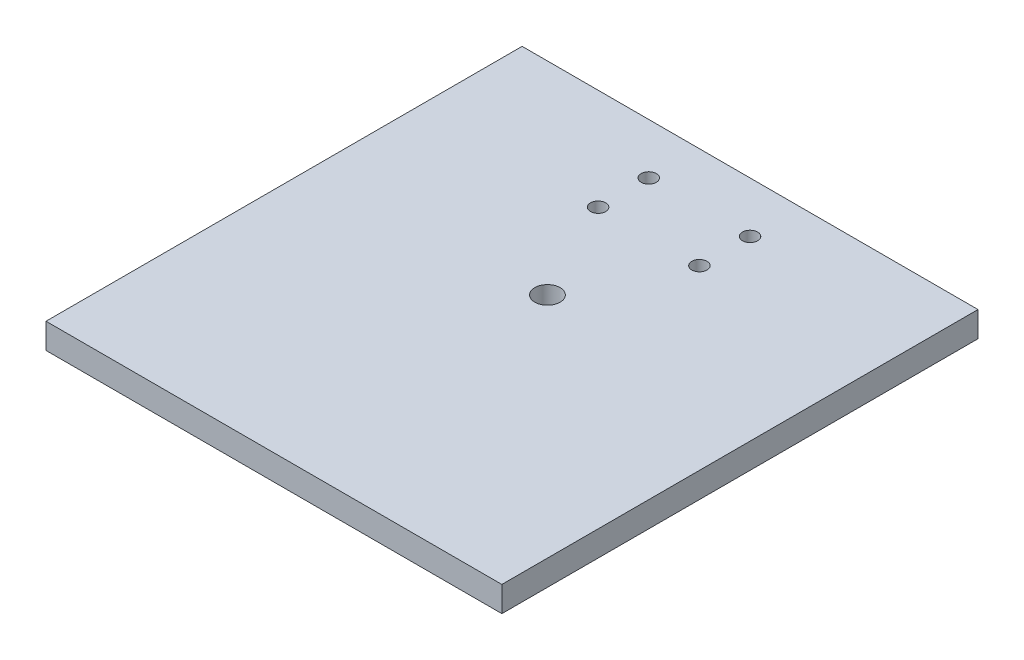
ISO-10303-21;
HEADER;
FILE_DESCRIPTION(('STEP AP214'),'2;1');
FILE_NAME('part.step','',(''),(''),'','','');
FILE_SCHEMA(('AUTOMOTIVE_DESIGN { 1 0 10303 214 1 1 1 1 }'));
ENDSEC;
DATA;
#1=APPLICATION_CONTEXT('core data for automotive mechanical design processes');
#2=APPLICATION_PROTOCOL_DEFINITION('international standard','automotive_design',2000,#1);
#3=PRODUCT_CONTEXT('',#1,'mechanical');
#4=PRODUCT('Part','Part','',(#3));
#5=PRODUCT_RELATED_PRODUCT_CATEGORY('part','',(#4));
#6=PRODUCT_DEFINITION_FORMATION('','',#4);
#7=PRODUCT_DEFINITION_CONTEXT('part definition',#1,'design');
#8=PRODUCT_DEFINITION('design','',#6,#7);
#9=PRODUCT_DEFINITION_SHAPE('','',#8);
#10=(LENGTH_UNIT() NAMED_UNIT(*) SI_UNIT(.MILLI.,.METRE.));
#11=(NAMED_UNIT(*) PLANE_ANGLE_UNIT() SI_UNIT($,.RADIAN.));
#12=(NAMED_UNIT(*) SI_UNIT($,.STERADIAN.) SOLID_ANGLE_UNIT());
#13=UNCERTAINTY_MEASURE_WITH_UNIT(LENGTH_MEASURE(1.E-05),#10,'distance_accuracy_value','');
#14=(GEOMETRIC_REPRESENTATION_CONTEXT(3) GLOBAL_UNCERTAINTY_ASSIGNED_CONTEXT((#13)) GLOBAL_UNIT_ASSIGNED_CONTEXT((#10,
#11,#12)) REPRESENTATION_CONTEXT('',''));
#15=CARTESIAN_POINT('',(0.,0.,0.));
#16=DIRECTION('',(0.,0.,1.));
#17=DIRECTION('',(1.,0.,0.));
#18=AXIS2_PLACEMENT_3D('',#15,#16,#17);
#19=CARTESIAN_POINT('',(0.,6.35,0.));
#20=DIRECTION('',(0.,0.,-1.));
#21=DIRECTION('',(-1.,0.,0.));
#22=AXIS2_PLACEMENT_3D('',#19,#20,#21);
#23=PLANE('',#22);
#24=DIRECTION('',(1.,0.,0.));
#25=VECTOR('',#24,1.);
#26=CARTESIAN_POINT('',(0.,0.,0.));
#27=LINE('',#26,#25);
#28=CARTESIAN_POINT('',(0.,0.,0.));
#29=VERTEX_POINT('',#28);
#30=CARTESIAN_POINT('',(114.3,0.,0.));
#31=VERTEX_POINT('',#30);
#32=EDGE_CURVE('E133',#29,#31,#27,.T.);
#33=ORIENTED_EDGE('',*,*,#32,.T.);
#34=DIRECTION('',(0.,-1.,0.));
#35=VECTOR('',#34,1.);
#36=CARTESIAN_POINT('',(114.3,6.35,0.));
#37=LINE('',#36,#35);
#38=CARTESIAN_POINT('',(114.3,6.35,0.));
#39=VERTEX_POINT('',#38);
#40=EDGE_CURVE('E11',#39,#31,#37,.T.);
#41=ORIENTED_EDGE('',*,*,#40,.F.);
#42=DIRECTION('',(1.,0.,0.));
#43=VECTOR('',#42,1.);
#44=CARTESIAN_POINT('',(0.,6.35,0.));
#45=LINE('',#44,#43);
#46=CARTESIAN_POINT('',(0.,6.35,0.));
#47=VERTEX_POINT('',#46);
#48=EDGE_CURVE('E95',#47,#39,#45,.T.);
#49=ORIENTED_EDGE('',*,*,#48,.F.);
#50=DIRECTION('',(0.,-1.,0.));
#51=VECTOR('',#50,1.);
#52=CARTESIAN_POINT('',(0.,6.35,0.));
#53=LINE('',#52,#51);
#54=EDGE_CURVE('E62',#47,#29,#53,.T.);
#55=ORIENTED_EDGE('',*,*,#54,.T.);
#56=EDGE_LOOP('',(#33,#41,#49,#55));
#57=FACE_BOUND('',#56,.T.);
#58=ADVANCED_FACE('F44',(#57),#23,.F.);
#59=CARTESIAN_POINT('',(114.3,6.35,0.));
#60=DIRECTION('',(-1.,0.,0.));
#61=DIRECTION('',(0.,0.,1.));
#62=AXIS2_PLACEMENT_3D('',#59,#60,#61);
#63=PLANE('',#62);
#64=DIRECTION('',(0.,0.,-1.));
#65=VECTOR('',#64,1.);
#66=CARTESIAN_POINT('',(114.3,0.,0.));
#67=LINE('',#66,#65);
#68=CARTESIAN_POINT('',(114.3,0.,-119.38));
#69=VERTEX_POINT('',#68);
#70=EDGE_CURVE('E101',#31,#69,#67,.T.);
#71=ORIENTED_EDGE('',*,*,#70,.T.);
#72=DIRECTION('',(0.,-1.,0.));
#73=VECTOR('',#72,1.);
#74=CARTESIAN_POINT('',(114.3,6.35,-119.38));
#75=LINE('',#74,#73);
#76=CARTESIAN_POINT('',(114.3,6.35,-119.38));
#77=VERTEX_POINT('',#76);
#78=EDGE_CURVE('E54',#77,#69,#75,.T.);
#79=ORIENTED_EDGE('',*,*,#78,.F.);
#80=DIRECTION('',(0.,0.,-1.));
#81=VECTOR('',#80,1.);
#82=CARTESIAN_POINT('',(114.3,6.35,0.));
#83=LINE('',#82,#81);
#84=EDGE_CURVE('E87',#39,#77,#83,.T.);
#85=ORIENTED_EDGE('',*,*,#84,.F.);
#86=ORIENTED_EDGE('',*,*,#40,.T.);
#87=EDGE_LOOP('',(#71,#79,#85,#86));
#88=FACE_BOUND('',#87,.T.);
#89=ADVANCED_FACE('F100',(#88),#63,.F.);
#90=CARTESIAN_POINT('',(0.,6.35,-119.38));
#91=DIRECTION('',(0.,0.,-1.));
#92=DIRECTION('',(-1.,0.,0.));
#93=AXIS2_PLACEMENT_3D('',#90,#91,#92);
#94=PLANE('',#93);
#95=DIRECTION('',(1.,0.,0.));
#96=VECTOR('',#95,1.);
#97=CARTESIAN_POINT('',(0.,0.,-119.38));
#98=LINE('',#97,#96);
#99=CARTESIAN_POINT('',(0.,0.,-119.38));
#100=VERTEX_POINT('',#99);
#101=EDGE_CURVE('E138',#100,#69,#98,.T.);
#102=ORIENTED_EDGE('',*,*,#101,.F.);
#103=DIRECTION('',(0.,-1.,0.));
#104=VECTOR('',#103,1.);
#105=CARTESIAN_POINT('',(0.,6.35,-119.38));
#106=LINE('',#105,#104);
#107=CARTESIAN_POINT('',(0.,6.35,-119.38));
#108=VERTEX_POINT('',#107);
#109=EDGE_CURVE('E76',#108,#100,#106,.T.);
#110=ORIENTED_EDGE('',*,*,#109,.F.);
#111=DIRECTION('',(1.,0.,0.));
#112=VECTOR('',#111,1.);
#113=CARTESIAN_POINT('',(0.,6.35,-119.38));
#114=LINE('',#113,#112);
#115=EDGE_CURVE('E94',#108,#77,#114,.T.);
#116=ORIENTED_EDGE('',*,*,#115,.T.);
#117=ORIENTED_EDGE('',*,*,#78,.T.);
#118=EDGE_LOOP('',(#102,#110,#116,#117));
#119=FACE_BOUND('',#118,.T.);
#120=ADVANCED_FACE('F105',(#119),#94,.T.);
#121=CARTESIAN_POINT('',(44.45,6.35,-106.68));
#122=DIRECTION('',(0.,-1.,0.));
#123=DIRECTION('',(0.,0.,-1.));
#124=AXIS2_PLACEMENT_3D('',#121,#122,#123);
#125=CYLINDRICAL_SURFACE('',#124,1.90500000000001);
#126=CARTESIAN_POINT('',(44.45,6.35,-106.68));
#127=DIRECTION('',(0.,1.,0.));
#128=DIRECTION('',(0.,0.,1.));
#129=AXIS2_PLACEMENT_3D('',#126,#127,#128);
#130=CIRCLE('',#129,1.90500000000001);
#131=CARTESIAN_POINT('',(44.45,6.35,-104.775));
#132=VERTEX_POINT('',#131);
#133=EDGE_CURVE('E168',#132,#132,#130,.T.);
#134=ORIENTED_EDGE('',*,*,#133,.T.);
#135=EDGE_LOOP('',(#134));
#136=FACE_BOUND('',#135,.T.);
#137=CARTESIAN_POINT('',(44.45,0.,-106.68));
#138=DIRECTION('',(0.,1.,0.));
#139=DIRECTION('',(0.,0.,1.));
#140=AXIS2_PLACEMENT_3D('',#137,#138,#139);
#141=CIRCLE('',#140,1.90500000000001);
#142=CARTESIAN_POINT('',(44.45,0.,-104.775));
#143=VERTEX_POINT('',#142);
#144=EDGE_CURVE('E129',#143,#143,#141,.T.);
#145=ORIENTED_EDGE('',*,*,#144,.F.);
#146=EDGE_LOOP('',(#145));
#147=FACE_BOUND('',#146,.T.);
#148=ADVANCED_FACE('F174',(#136,#147),#125,.F.);
#149=CARTESIAN_POINT('',(69.85,6.35,-106.68));
#150=DIRECTION('',(0.,-1.,0.));
#151=DIRECTION('',(0.,0.,-1.));
#152=AXIS2_PLACEMENT_3D('',#149,#150,#151);
#153=CYLINDRICAL_SURFACE('',#152,1.90500000000001);
#154=CARTESIAN_POINT('',(69.85,6.35,-106.68));
#155=DIRECTION('',(0.,1.,0.));
#156=DIRECTION('',(0.,0.,1.));
#157=AXIS2_PLACEMENT_3D('',#154,#155,#156);
#158=CIRCLE('',#157,1.90500000000001);
#159=CARTESIAN_POINT('',(69.85,6.35,-104.775));
#160=VERTEX_POINT('',#159);
#161=EDGE_CURVE('E164',#160,#160,#158,.T.);
#162=ORIENTED_EDGE('',*,*,#161,.T.);
#163=EDGE_LOOP('',(#162));
#164=FACE_BOUND('',#163,.T.);
#165=CARTESIAN_POINT('',(69.85,0.,-106.68));
#166=DIRECTION('',(0.,1.,0.));
#167=DIRECTION('',(0.,0.,1.));
#168=AXIS2_PLACEMENT_3D('',#165,#166,#167);
#169=CIRCLE('',#168,1.90500000000001);
#170=CARTESIAN_POINT('',(69.85,0.,-104.775));
#171=VERTEX_POINT('',#170);
#172=EDGE_CURVE('E125',#171,#171,#169,.T.);
#173=ORIENTED_EDGE('',*,*,#172,.F.);
#174=EDGE_LOOP('',(#173));
#175=FACE_BOUND('',#174,.T.);
#176=ADVANCED_FACE('F200',(#164,#175),#153,.F.);
#177=CARTESIAN_POINT('',(44.45,6.35,-93.98));
#178=DIRECTION('',(0.,-1.,0.));
#179=DIRECTION('',(0.,0.,-1.));
#180=AXIS2_PLACEMENT_3D('',#177,#178,#179);
#181=CYLINDRICAL_SURFACE('',#180,1.90500000000001);
#182=CARTESIAN_POINT('',(44.45,6.35,-93.98));
#183=DIRECTION('',(0.,1.,0.));
#184=DIRECTION('',(0.,0.,1.));
#185=AXIS2_PLACEMENT_3D('',#182,#183,#184);
#186=CIRCLE('',#185,1.90500000000001);
#187=CARTESIAN_POINT('',(44.45,6.35,-92.075));
#188=VERTEX_POINT('',#187);
#189=EDGE_CURVE('E158',#188,#188,#186,.T.);
#190=ORIENTED_EDGE('',*,*,#189,.T.);
#191=EDGE_LOOP('',(#190));
#192=FACE_BOUND('',#191,.T.);
#193=CARTESIAN_POINT('',(44.45,0.,-93.98));
#194=DIRECTION('',(0.,1.,0.));
#195=DIRECTION('',(0.,0.,1.));
#196=AXIS2_PLACEMENT_3D('',#193,#194,#195);
#197=CIRCLE('',#196,1.90500000000001);
#198=CARTESIAN_POINT('',(44.45,0.,-92.075));
#199=VERTEX_POINT('',#198);
#200=EDGE_CURVE('E121',#199,#199,#197,.T.);
#201=ORIENTED_EDGE('',*,*,#200,.F.);
#202=EDGE_LOOP('',(#201));
#203=FACE_BOUND('',#202,.T.);
#204=ADVANCED_FACE('F203',(#192,#203),#181,.F.);
#205=CARTESIAN_POINT('',(69.85,6.35,-93.98));
#206=DIRECTION('',(0.,-1.,0.));
#207=DIRECTION('',(0.,0.,-1.));
#208=AXIS2_PLACEMENT_3D('',#205,#206,#207);
#209=CYLINDRICAL_SURFACE('',#208,1.90500000000001);
#210=CARTESIAN_POINT('',(69.85,6.35,-93.98));
#211=DIRECTION('',(0.,1.,0.));
#212=DIRECTION('',(0.,0.,1.));
#213=AXIS2_PLACEMENT_3D('',#210,#211,#212);
#214=CIRCLE('',#213,1.90500000000001);
#215=CARTESIAN_POINT('',(69.85,6.35,-92.075));
#216=VERTEX_POINT('',#215);
#217=EDGE_CURVE('E152',#216,#216,#214,.T.);
#218=ORIENTED_EDGE('',*,*,#217,.T.);
#219=EDGE_LOOP('',(#218));
#220=FACE_BOUND('',#219,.T.);
#221=CARTESIAN_POINT('',(69.85,0.,-93.98));
#222=DIRECTION('',(0.,1.,0.));
#223=DIRECTION('',(0.,0.,1.));
#224=AXIS2_PLACEMENT_3D('',#221,#222,#223);
#225=CIRCLE('',#224,1.90500000000001);
#226=CARTESIAN_POINT('',(69.85,0.,-92.075));
#227=VERTEX_POINT('',#226);
#228=EDGE_CURVE('E117',#227,#227,#225,.T.);
#229=ORIENTED_EDGE('',*,*,#228,.F.);
#230=EDGE_LOOP('',(#229));
#231=FACE_BOUND('',#230,.T.);
#232=ADVANCED_FACE('F206',(#220,#231),#209,.F.);
#233=CARTESIAN_POINT('',(57.15,6.35,-68.58));
#234=DIRECTION('',(0.,-1.,0.));
#235=DIRECTION('',(0.,0.,-1.));
#236=AXIS2_PLACEMENT_3D('',#233,#234,#235);
#237=CYLINDRICAL_SURFACE('',#236,3.175);
#238=CARTESIAN_POINT('',(57.15,6.35,-68.58));
#239=DIRECTION('',(0.,1.,0.));
#240=DIRECTION('',(0.,0.,1.));
#241=AXIS2_PLACEMENT_3D('',#238,#239,#240);
#242=CIRCLE('',#241,3.175);
#243=CARTESIAN_POINT('',(57.15,6.35,-65.405));
#244=VERTEX_POINT('',#243);
#245=EDGE_CURVE('E145',#244,#244,#242,.T.);
#246=ORIENTED_EDGE('',*,*,#245,.T.);
#247=EDGE_LOOP('',(#246));
#248=FACE_BOUND('',#247,.T.);
#249=CARTESIAN_POINT('',(57.15,0.,-68.58));
#250=DIRECTION('',(0.,1.,0.));
#251=DIRECTION('',(0.,0.,1.));
#252=AXIS2_PLACEMENT_3D('',#249,#250,#251);
#253=CIRCLE('',#252,3.175);
#254=CARTESIAN_POINT('',(57.15,0.,-65.405));
#255=VERTEX_POINT('',#254);
#256=EDGE_CURVE('E113',#255,#255,#253,.T.);
#257=ORIENTED_EDGE('',*,*,#256,.F.);
#258=EDGE_LOOP('',(#257));
#259=FACE_BOUND('',#258,.T.);
#260=ADVANCED_FACE('F46',(#248,#259),#237,.F.);
#261=CARTESIAN_POINT('',(0.,6.35,0.));
#262=DIRECTION('',(-1.,0.,0.));
#263=DIRECTION('',(0.,0.,1.));
#264=AXIS2_PLACEMENT_3D('',#261,#262,#263);
#265=PLANE('',#264);
#266=DIRECTION('',(0.,0.,-1.));
#267=VECTOR('',#266,1.);
#268=CARTESIAN_POINT('',(0.,0.,0.));
#269=LINE('',#268,#267);
#270=EDGE_CURVE('E141',#29,#100,#269,.T.);
#271=ORIENTED_EDGE('',*,*,#270,.F.);
#272=ORIENTED_EDGE('',*,*,#54,.F.);
#273=DIRECTION('',(0.,0.,-1.));
#274=VECTOR('',#273,1.);
#275=CARTESIAN_POINT('',(0.,6.35,0.));
#276=LINE('',#275,#274);
#277=EDGE_CURVE('E107',#47,#108,#276,.T.);
#278=ORIENTED_EDGE('',*,*,#277,.T.);
#279=ORIENTED_EDGE('',*,*,#109,.T.);
#280=EDGE_LOOP('',(#271,#272,#278,#279));
#281=FACE_BOUND('',#280,.T.);
#282=ADVANCED_FACE('F179',(#281),#265,.T.);
#283=CARTESIAN_POINT('',(0.,6.35,0.));
#284=DIRECTION('',(0.,1.,0.));
#285=DIRECTION('',(0.,0.,1.));
#286=AXIS2_PLACEMENT_3D('',#283,#284,#285);
#287=PLANE('',#286);
#288=ORIENTED_EDGE('',*,*,#245,.F.);
#289=EDGE_LOOP('',(#288));
#290=FACE_BOUND('',#289,.T.);
#291=ORIENTED_EDGE('',*,*,#217,.F.);
#292=EDGE_LOOP('',(#291));
#293=FACE_BOUND('',#292,.T.);
#294=ORIENTED_EDGE('',*,*,#189,.F.);
#295=EDGE_LOOP('',(#294));
#296=FACE_BOUND('',#295,.T.);
#297=ORIENTED_EDGE('',*,*,#161,.F.);
#298=EDGE_LOOP('',(#297));
#299=FACE_BOUND('',#298,.T.);
#300=ORIENTED_EDGE('',*,*,#133,.F.);
#301=EDGE_LOOP('',(#300));
#302=FACE_BOUND('',#301,.T.);
#303=ORIENTED_EDGE('',*,*,#48,.T.);
#304=ORIENTED_EDGE('',*,*,#84,.T.);
#305=ORIENTED_EDGE('',*,*,#115,.F.);
#306=ORIENTED_EDGE('',*,*,#277,.F.);
#307=EDGE_LOOP('',(#303,#304,#305,#306));
#308=FACE_BOUND('',#307,.T.);
#309=ADVANCED_FACE('F91',(#290,#293,#296,#299,#302,#308),#287,.T.);
#310=CARTESIAN_POINT('',(0.,0.,0.));
#311=DIRECTION('',(0.,1.,0.));
#312=DIRECTION('',(0.,0.,1.));
#313=AXIS2_PLACEMENT_3D('',#310,#311,#312);
#314=PLANE('',#313);
#315=ORIENTED_EDGE('',*,*,#256,.T.);
#316=EDGE_LOOP('',(#315));
#317=FACE_BOUND('',#316,.T.);
#318=ORIENTED_EDGE('',*,*,#228,.T.);
#319=EDGE_LOOP('',(#318));
#320=FACE_BOUND('',#319,.T.);
#321=ORIENTED_EDGE('',*,*,#200,.T.);
#322=EDGE_LOOP('',(#321));
#323=FACE_BOUND('',#322,.T.);
#324=ORIENTED_EDGE('',*,*,#172,.T.);
#325=EDGE_LOOP('',(#324));
#326=FACE_BOUND('',#325,.T.);
#327=ORIENTED_EDGE('',*,*,#144,.T.);
#328=EDGE_LOOP('',(#327));
#329=FACE_BOUND('',#328,.T.);
#330=ORIENTED_EDGE('',*,*,#32,.F.);
#331=ORIENTED_EDGE('',*,*,#270,.T.);
#332=ORIENTED_EDGE('',*,*,#101,.T.);
#333=ORIENTED_EDGE('',*,*,#70,.F.);
#334=EDGE_LOOP('',(#330,#331,#332,#333));
#335=FACE_BOUND('',#334,.T.);
#336=ADVANCED_FACE('F178',(#317,#320,#323,#326,#329,#335),#314,.F.);
#337=CLOSED_SHELL('',(#58,#89,#120,#148,#176,#204,#232,#260,#282,#309,#336));
#338=MANIFOLD_SOLID_BREP('B2',#337);
#339=ADVANCED_BREP_SHAPE_REPRESENTATION('',(#18,#338),#14);
#340=SHAPE_DEFINITION_REPRESENTATION(#9,#339);
ENDSEC;
END-ISO-10303-21;
